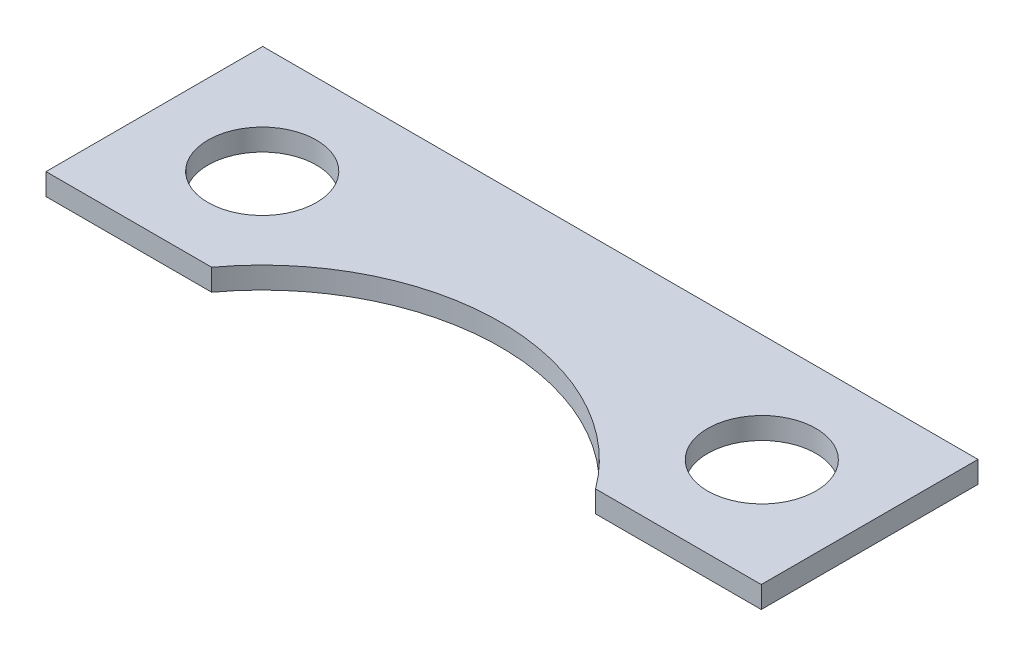
ISO-10303-21;
HEADER;
FILE_DESCRIPTION(('STEP AP214'),'2;1');
FILE_NAME('part.step','',(''),(''),'','','');
FILE_SCHEMA(('AUTOMOTIVE_DESIGN { 1 0 10303 214 1 1 1 1 }'));
ENDSEC;
DATA;
#1=APPLICATION_CONTEXT('core data for automotive mechanical design processes');
#2=APPLICATION_PROTOCOL_DEFINITION('international standard','automotive_design',2000,#1);
#3=PRODUCT_CONTEXT('',#1,'mechanical');
#4=PRODUCT('Part','Part','',(#3));
#5=PRODUCT_RELATED_PRODUCT_CATEGORY('part','',(#4));
#6=PRODUCT_DEFINITION_FORMATION('','',#4);
#7=PRODUCT_DEFINITION_CONTEXT('part definition',#1,'design');
#8=PRODUCT_DEFINITION('design','',#6,#7);
#9=PRODUCT_DEFINITION_SHAPE('','',#8);
#10=(LENGTH_UNIT() NAMED_UNIT(*) SI_UNIT(.MILLI.,.METRE.));
#11=(NAMED_UNIT(*) PLANE_ANGLE_UNIT() SI_UNIT($,.RADIAN.));
#12=(NAMED_UNIT(*) SI_UNIT($,.STERADIAN.) SOLID_ANGLE_UNIT());
#13=UNCERTAINTY_MEASURE_WITH_UNIT(LENGTH_MEASURE(1.E-05),#10,'distance_accuracy_value','');
#14=(GEOMETRIC_REPRESENTATION_CONTEXT(3) GLOBAL_UNCERTAINTY_ASSIGNED_CONTEXT((#13)) GLOBAL_UNIT_ASSIGNED_CONTEXT((#10,
#11,#12)) REPRESENTATION_CONTEXT('',''));
#15=CARTESIAN_POINT('',(0.,0.,0.));
#16=DIRECTION('',(0.,0.,1.));
#17=DIRECTION('',(1.,0.,0.));
#18=AXIS2_PLACEMENT_3D('',#15,#16,#17);
#19=CARTESIAN_POINT('',(0.,1.,6.525));
#20=DIRECTION('',(0.,1.,0.));
#21=DIRECTION('',(0.,0.,1.));
#22=AXIS2_PLACEMENT_3D('',#19,#20,#21);
#23=PLANE('',#22);
#24=CARTESIAN_POINT('',(-11.525,1.,-5.));
#25=DIRECTION('',(0.,1.,0.));
#26=DIRECTION('',(0.,0.,1.));
#27=AXIS2_PLACEMENT_3D('',#24,#25,#26);
#28=CIRCLE('',#27,2.5);
#29=CARTESIAN_POINT('',(-11.525,1.,-2.5));
#30=VERTEX_POINT('',#29);
#31=EDGE_CURVE('E123',#30,#30,#28,.T.);
#32=ORIENTED_EDGE('',*,*,#31,.F.);
#33=EDGE_LOOP('',(#32));
#34=FACE_BOUND('',#33,.T.);
#35=DIRECTION('',(0.,0.,1.));
#36=VECTOR('',#35,1.);
#37=CARTESIAN_POINT('',(-16.5,1.,-10.));
#38=LINE('',#37,#36);
#39=CARTESIAN_POINT('',(-16.5,1.,-10.));
#40=VERTEX_POINT('',#39);
#41=CARTESIAN_POINT('',(-16.5,1.,0.));
#42=VERTEX_POINT('',#41);
#43=EDGE_CURVE('E130',#40,#42,#38,.T.);
#44=ORIENTED_EDGE('',*,*,#43,.T.);
#45=DIRECTION('',(1.,0.,0.));
#46=VECTOR('',#45,1.);
#47=CARTESIAN_POINT('',(-16.5,1.,0.));
#48=LINE('',#47,#46);
#49=CARTESIAN_POINT('',(-8.85575377932336,1.,0.));
#50=VERTEX_POINT('',#49);
#51=EDGE_CURVE('E88',#42,#50,#48,.T.);
#52=ORIENTED_EDGE('',*,*,#51,.T.);
#53=CARTESIAN_POINT('',(0.,1.,6.525));
#54=DIRECTION('',(0.,-1.,0.));
#55=DIRECTION('',(0.,0.,1.));
#56=AXIS2_PLACEMENT_3D('',#53,#54,#55);
#57=CIRCLE('',#56,11.);
#58=CARTESIAN_POINT('',(8.85575377932336,1.,0.));
#59=VERTEX_POINT('',#58);
#60=EDGE_CURVE('E101',#50,#59,#57,.T.);
#61=ORIENTED_EDGE('',*,*,#60,.T.);
#62=DIRECTION('',(1.,0.,0.));
#63=VECTOR('',#62,1.);
#64=CARTESIAN_POINT('',(8.85575377932336,1.,0.));
#65=LINE('',#64,#63);
#66=CARTESIAN_POINT('',(16.5,1.,0.));
#67=VERTEX_POINT('',#66);
#68=EDGE_CURVE('E95',#59,#67,#65,.T.);
#69=ORIENTED_EDGE('',*,*,#68,.T.);
#70=DIRECTION('',(0.,0.,-1.));
#71=VECTOR('',#70,1.);
#72=CARTESIAN_POINT('',(16.5,1.,-10.));
#73=LINE('',#72,#71);
#74=CARTESIAN_POINT('',(16.5,1.,-10.));
#75=VERTEX_POINT('',#74);
#76=EDGE_CURVE('E99',#67,#75,#73,.T.);
#77=ORIENTED_EDGE('',*,*,#76,.T.);
#78=DIRECTION('',(-1.,0.,0.));
#79=VECTOR('',#78,1.);
#80=CARTESIAN_POINT('',(-16.5,1.,-10.));
#81=LINE('',#80,#79);
#82=EDGE_CURVE('E51',#75,#40,#81,.T.);
#83=ORIENTED_EDGE('',*,*,#82,.T.);
#84=EDGE_LOOP('',(#44,#52,#61,#69,#77,#83));
#85=FACE_BOUND('',#84,.T.);
#86=CARTESIAN_POINT('',(11.525,1.,-5.));
#87=DIRECTION('',(0.,1.,0.));
#88=DIRECTION('',(0.,0.,1.));
#89=AXIS2_PLACEMENT_3D('',#86,#87,#88);
#90=CIRCLE('',#89,2.5);
#91=CARTESIAN_POINT('',(11.525,1.,-2.5));
#92=VERTEX_POINT('',#91);
#93=EDGE_CURVE('E172',#92,#92,#90,.T.);
#94=ORIENTED_EDGE('',*,*,#93,.F.);
#95=EDGE_LOOP('',(#94));
#96=FACE_BOUND('',#95,.T.);
#97=ADVANCED_FACE('F34',(#34,#85,#96),#23,.T.);
#98=CARTESIAN_POINT('',(0.,0.,6.525));
#99=DIRECTION('',(0.,1.,0.));
#100=DIRECTION('',(0.,0.,1.));
#101=AXIS2_PLACEMENT_3D('',#98,#99,#100);
#102=PLANE('',#101);
#103=DIRECTION('',(0.,0.,1.));
#104=VECTOR('',#103,1.);
#105=CARTESIAN_POINT('',(-16.5,0.,-10.));
#106=LINE('',#105,#104);
#107=CARTESIAN_POINT('',(-16.5,0.,-10.));
#108=VERTEX_POINT('',#107);
#109=CARTESIAN_POINT('',(-16.5,0.,0.));
#110=VERTEX_POINT('',#109);
#111=EDGE_CURVE('E119',#108,#110,#106,.T.);
#112=ORIENTED_EDGE('',*,*,#111,.F.);
#113=DIRECTION('',(-1.,0.,0.));
#114=VECTOR('',#113,1.);
#115=CARTESIAN_POINT('',(-16.5,0.,-10.));
#116=LINE('',#115,#114);
#117=CARTESIAN_POINT('',(16.5,0.,-10.));
#118=VERTEX_POINT('',#117);
#119=EDGE_CURVE('E80',#118,#108,#116,.T.);
#120=ORIENTED_EDGE('',*,*,#119,.F.);
#121=DIRECTION('',(0.,0.,-1.));
#122=VECTOR('',#121,1.);
#123=CARTESIAN_POINT('',(16.5,0.,-10.));
#124=LINE('',#123,#122);
#125=CARTESIAN_POINT('',(16.5,0.,0.));
#126=VERTEX_POINT('',#125);
#127=EDGE_CURVE('E74',#126,#118,#124,.T.);
#128=ORIENTED_EDGE('',*,*,#127,.F.);
#129=DIRECTION('',(1.,0.,0.));
#130=VECTOR('',#129,1.);
#131=CARTESIAN_POINT('',(8.85575377932336,0.,0.));
#132=LINE('',#131,#130);
#133=CARTESIAN_POINT('',(8.85575377932336,0.,0.));
#134=VERTEX_POINT('',#133);
#135=EDGE_CURVE('E109',#134,#126,#132,.T.);
#136=ORIENTED_EDGE('',*,*,#135,.F.);
#137=CARTESIAN_POINT('',(0.,0.,6.525));
#138=DIRECTION('',(0.,-1.,0.));
#139=DIRECTION('',(0.,0.,1.));
#140=AXIS2_PLACEMENT_3D('',#137,#138,#139);
#141=CIRCLE('',#140,11.);
#142=CARTESIAN_POINT('',(-8.85575377932336,0.,0.));
#143=VERTEX_POINT('',#142);
#144=EDGE_CURVE('E125',#143,#134,#141,.T.);
#145=ORIENTED_EDGE('',*,*,#144,.F.);
#146=DIRECTION('',(1.,0.,0.));
#147=VECTOR('',#146,1.);
#148=CARTESIAN_POINT('',(-16.5,0.,0.));
#149=LINE('',#148,#147);
#150=EDGE_CURVE('E122',#110,#143,#149,.T.);
#151=ORIENTED_EDGE('',*,*,#150,.F.);
#152=EDGE_LOOP('',(#112,#120,#128,#136,#145,#151));
#153=FACE_BOUND('',#152,.T.);
#154=CARTESIAN_POINT('',(-11.525,0.,-5.));
#155=DIRECTION('',(0.,1.,0.));
#156=DIRECTION('',(0.,0.,1.));
#157=AXIS2_PLACEMENT_3D('',#154,#155,#156);
#158=CIRCLE('',#157,2.5);
#159=CARTESIAN_POINT('',(-11.525,0.,-2.5));
#160=VERTEX_POINT('',#159);
#161=EDGE_CURVE('E178',#160,#160,#158,.T.);
#162=ORIENTED_EDGE('',*,*,#161,.T.);
#163=EDGE_LOOP('',(#162));
#164=FACE_BOUND('',#163,.T.);
#165=CARTESIAN_POINT('',(11.525,0.,-5.));
#166=DIRECTION('',(0.,1.,0.));
#167=DIRECTION('',(0.,0.,1.));
#168=AXIS2_PLACEMENT_3D('',#165,#166,#167);
#169=CIRCLE('',#168,2.5);
#170=CARTESIAN_POINT('',(11.525,0.,-2.5));
#171=VERTEX_POINT('',#170);
#172=EDGE_CURVE('E175',#171,#171,#169,.T.);
#173=ORIENTED_EDGE('',*,*,#172,.T.);
#174=EDGE_LOOP('',(#173));
#175=FACE_BOUND('',#174,.T.);
#176=ADVANCED_FACE('F139',(#153,#164,#175),#102,.F.);
#177=CARTESIAN_POINT('',(-16.5,1.,-10.));
#178=DIRECTION('',(1.,0.,0.));
#179=DIRECTION('',(0.,0.,-1.));
#180=AXIS2_PLACEMENT_3D('',#177,#178,#179);
#181=PLANE('',#180);
#182=ORIENTED_EDGE('',*,*,#111,.T.);
#183=DIRECTION('',(0.,-1.,0.));
#184=VECTOR('',#183,1.);
#185=CARTESIAN_POINT('',(-16.5,1.,0.));
#186=LINE('',#185,#184);
#187=EDGE_CURVE('E11',#42,#110,#186,.T.);
#188=ORIENTED_EDGE('',*,*,#187,.F.);
#189=ORIENTED_EDGE('',*,*,#43,.F.);
#190=DIRECTION('',(0.,-1.,0.));
#191=VECTOR('',#190,1.);
#192=CARTESIAN_POINT('',(-16.5,1.,-10.));
#193=LINE('',#192,#191);
#194=EDGE_CURVE('E115',#40,#108,#193,.T.);
#195=ORIENTED_EDGE('',*,*,#194,.T.);
#196=EDGE_LOOP('',(#182,#188,#189,#195));
#197=FACE_BOUND('',#196,.T.);
#198=ADVANCED_FACE('F36',(#197),#181,.F.);
#199=CARTESIAN_POINT('',(-16.5,1.,0.));
#200=DIRECTION('',(0.,0.,-1.));
#201=DIRECTION('',(-1.,0.,0.));
#202=AXIS2_PLACEMENT_3D('',#199,#200,#201);
#203=PLANE('',#202);
#204=ORIENTED_EDGE('',*,*,#150,.T.);
#205=DIRECTION('',(0.,-1.,0.));
#206=VECTOR('',#205,1.);
#207=CARTESIAN_POINT('',(-8.85575377932336,1.,0.));
#208=LINE('',#207,#206);
#209=EDGE_CURVE('E43',#50,#143,#208,.T.);
#210=ORIENTED_EDGE('',*,*,#209,.F.);
#211=ORIENTED_EDGE('',*,*,#51,.F.);
#212=ORIENTED_EDGE('',*,*,#187,.T.);
#213=EDGE_LOOP('',(#204,#210,#211,#212));
#214=FACE_BOUND('',#213,.T.);
#215=ADVANCED_FACE('F219',(#214),#203,.F.);
#216=CARTESIAN_POINT('',(0.,1.,6.525));
#217=DIRECTION('',(0.,-1.,0.));
#218=DIRECTION('',(0.,0.,-1.));
#219=AXIS2_PLACEMENT_3D('',#216,#217,#218);
#220=CYLINDRICAL_SURFACE('',#219,11.);
#221=ORIENTED_EDGE('',*,*,#144,.T.);
#222=DIRECTION('',(0.,-1.,0.));
#223=VECTOR('',#222,1.);
#224=CARTESIAN_POINT('',(8.85575377932336,1.,0.));
#225=LINE('',#224,#223);
#226=EDGE_CURVE('E110',#59,#134,#225,.T.);
#227=ORIENTED_EDGE('',*,*,#226,.F.);
#228=ORIENTED_EDGE('',*,*,#60,.F.);
#229=ORIENTED_EDGE('',*,*,#209,.T.);
#230=EDGE_LOOP('',(#221,#227,#228,#229));
#231=FACE_BOUND('',#230,.T.);
#232=ADVANCED_FACE('F136',(#231),#220,.F.);
#233=CARTESIAN_POINT('',(8.85575377932336,1.,0.));
#234=DIRECTION('',(0.,0.,-1.));
#235=DIRECTION('',(-1.,0.,0.));
#236=AXIS2_PLACEMENT_3D('',#233,#234,#235);
#237=PLANE('',#236);
#238=ORIENTED_EDGE('',*,*,#135,.T.);
#239=DIRECTION('',(0.,-1.,0.));
#240=VECTOR('',#239,1.);
#241=CARTESIAN_POINT('',(16.5,1.,0.));
#242=LINE('',#241,#240);
#243=EDGE_CURVE('E106',#67,#126,#242,.T.);
#244=ORIENTED_EDGE('',*,*,#243,.F.);
#245=ORIENTED_EDGE('',*,*,#68,.F.);
#246=ORIENTED_EDGE('',*,*,#226,.T.);
#247=EDGE_LOOP('',(#238,#244,#245,#246));
#248=FACE_BOUND('',#247,.T.);
#249=ADVANCED_FACE('F107',(#248),#237,.F.);
#250=CARTESIAN_POINT('',(16.5,1.,-10.));
#251=DIRECTION('',(-1.,0.,0.));
#252=DIRECTION('',(0.,0.,1.));
#253=AXIS2_PLACEMENT_3D('',#250,#251,#252);
#254=PLANE('',#253);
#255=ORIENTED_EDGE('',*,*,#127,.T.);
#256=DIRECTION('',(0.,-1.,0.));
#257=VECTOR('',#256,1.);
#258=CARTESIAN_POINT('',(16.5,1.,-10.));
#259=LINE('',#258,#257);
#260=EDGE_CURVE('E111',#75,#118,#259,.T.);
#261=ORIENTED_EDGE('',*,*,#260,.F.);
#262=ORIENTED_EDGE('',*,*,#76,.F.);
#263=ORIENTED_EDGE('',*,*,#243,.T.);
#264=EDGE_LOOP('',(#255,#261,#262,#263));
#265=FACE_BOUND('',#264,.T.);
#266=ADVANCED_FACE('F113',(#265),#254,.F.);
#267=CARTESIAN_POINT('',(-16.5,1.,-10.));
#268=DIRECTION('',(0.,0.,1.));
#269=DIRECTION('',(1.,0.,0.));
#270=AXIS2_PLACEMENT_3D('',#267,#268,#269);
#271=PLANE('',#270);
#272=ORIENTED_EDGE('',*,*,#119,.T.);
#273=ORIENTED_EDGE('',*,*,#194,.F.);
#274=ORIENTED_EDGE('',*,*,#82,.F.);
#275=ORIENTED_EDGE('',*,*,#260,.T.);
#276=EDGE_LOOP('',(#272,#273,#274,#275));
#277=FACE_BOUND('',#276,.T.);
#278=ADVANCED_FACE('F144',(#277),#271,.F.);
#279=CARTESIAN_POINT('',(-11.525,1.,-5.));
#280=DIRECTION('',(0.,-1.,0.));
#281=DIRECTION('',(0.,0.,-1.));
#282=AXIS2_PLACEMENT_3D('',#279,#280,#281);
#283=CYLINDRICAL_SURFACE('',#282,2.5);
#284=ORIENTED_EDGE('',*,*,#31,.T.);
#285=EDGE_LOOP('',(#284));
#286=FACE_BOUND('',#285,.T.);
#287=ORIENTED_EDGE('',*,*,#161,.F.);
#288=EDGE_LOOP('',(#287));
#289=FACE_BOUND('',#288,.T.);
#290=ADVANCED_FACE('F146',(#286,#289),#283,.F.);
#291=CARTESIAN_POINT('',(11.525,1.,-5.));
#292=DIRECTION('',(0.,-1.,0.));
#293=DIRECTION('',(0.,0.,-1.));
#294=AXIS2_PLACEMENT_3D('',#291,#292,#293);
#295=CYLINDRICAL_SURFACE('',#294,2.5);
#296=ORIENTED_EDGE('',*,*,#93,.T.);
#297=EDGE_LOOP('',(#296));
#298=FACE_BOUND('',#297,.T.);
#299=ORIENTED_EDGE('',*,*,#172,.F.);
#300=EDGE_LOOP('',(#299));
#301=FACE_BOUND('',#300,.T.);
#302=ADVANCED_FACE('F152',(#298,#301),#295,.F.);
#303=CLOSED_SHELL('',(#97,#176,#198,#215,#232,#249,#266,#278,#290,#302));
#304=MANIFOLD_SOLID_BREP('B2',#303);
#305=ADVANCED_BREP_SHAPE_REPRESENTATION('',(#18,#304),#14);
#306=SHAPE_DEFINITION_REPRESENTATION(#9,#305);
ENDSEC;
END-ISO-10303-21;
